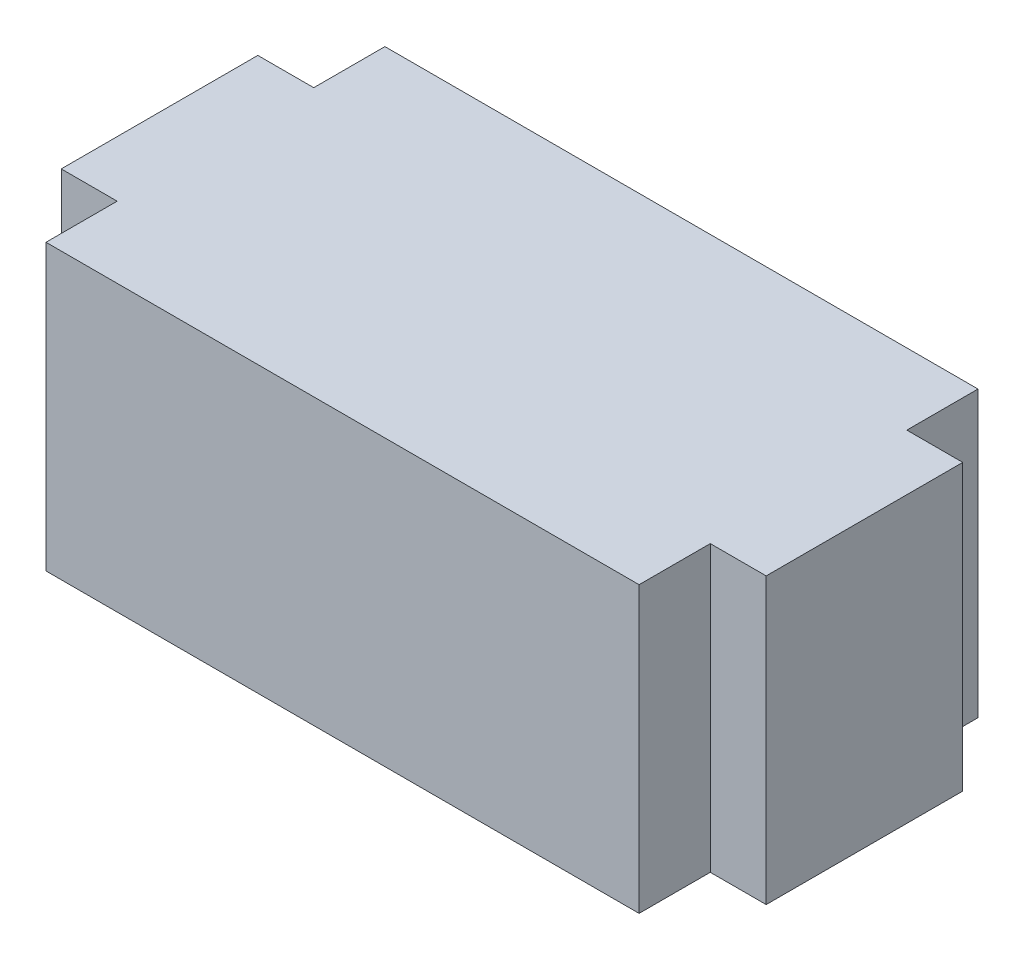
ISO-10303-21;
HEADER;
FILE_DESCRIPTION(('STEP AP214'),'2;1');
FILE_NAME('part.step','',(''),(''),'','','');
FILE_SCHEMA(('AUTOMOTIVE_DESIGN { 1 0 10303 214 1 1 1 1 }'));
ENDSEC;
DATA;
#1=APPLICATION_CONTEXT('core data for automotive mechanical design processes');
#2=APPLICATION_PROTOCOL_DEFINITION('international standard','automotive_design',2000,#1);
#3=PRODUCT_CONTEXT('',#1,'mechanical');
#4=PRODUCT('Part','Part','',(#3));
#5=PRODUCT_RELATED_PRODUCT_CATEGORY('part','',(#4));
#6=PRODUCT_DEFINITION_FORMATION('','',#4);
#7=PRODUCT_DEFINITION_CONTEXT('part definition',#1,'design');
#8=PRODUCT_DEFINITION('design','',#6,#7);
#9=PRODUCT_DEFINITION_SHAPE('','',#8);
#10=(LENGTH_UNIT() NAMED_UNIT(*) SI_UNIT(.MILLI.,.METRE.));
#11=(NAMED_UNIT(*) PLANE_ANGLE_UNIT() SI_UNIT($,.RADIAN.));
#12=(NAMED_UNIT(*) SI_UNIT($,.STERADIAN.) SOLID_ANGLE_UNIT());
#13=UNCERTAINTY_MEASURE_WITH_UNIT(LENGTH_MEASURE(1.E-05),#10,'distance_accuracy_value','');
#14=(GEOMETRIC_REPRESENTATION_CONTEXT(3) GLOBAL_UNCERTAINTY_ASSIGNED_CONTEXT((#13)) GLOBAL_UNIT_ASSIGNED_CONTEXT((#10,
#11,#12)) REPRESENTATION_CONTEXT('',''));
#15=CARTESIAN_POINT('',(0.,0.,0.));
#16=DIRECTION('',(0.,0.,1.));
#17=DIRECTION('',(1.,0.,0.));
#18=AXIS2_PLACEMENT_3D('',#15,#16,#17);
#19=CARTESIAN_POINT('',(0.,0.,2.5));
#20=DIRECTION('',(1.,0.,0.));
#21=DIRECTION('',(0.,0.,-1.));
#22=AXIS2_PLACEMENT_3D('',#19,#20,#21);
#23=PLANE('',#22);
#24=DIRECTION('',(0.,0.,-1.));
#25=VECTOR('',#24,1.);
#26=CARTESIAN_POINT('',(0.,0.,2.5));
#27=LINE('',#26,#25);
#28=CARTESIAN_POINT('',(0.,0.,1.975));
#29=VERTEX_POINT('',#28);
#30=CARTESIAN_POINT('',(0.,0.,0.525));
#31=VERTEX_POINT('',#30);
#32=EDGE_CURVE('E11',#29,#31,#27,.T.);
#33=ORIENTED_EDGE('',*,*,#32,.F.);
#34=DIRECTION('',(0.,1.,0.));
#35=VECTOR('',#34,1.);
#36=CARTESIAN_POINT('',(0.,0.,1.975));
#37=LINE('',#36,#35);
#38=CARTESIAN_POINT('',(0.,2.1,1.975));
#39=VERTEX_POINT('',#38);
#40=EDGE_CURVE('E169',#29,#39,#37,.T.);
#41=ORIENTED_EDGE('',*,*,#40,.T.);
#42=DIRECTION('',(0.,0.,-1.));
#43=VECTOR('',#42,1.);
#44=CARTESIAN_POINT('',(0.,2.1,2.5));
#45=LINE('',#44,#43);
#46=CARTESIAN_POINT('',(0.,2.1,0.525));
#47=VERTEX_POINT('',#46);
#48=EDGE_CURVE('E213',#39,#47,#45,.T.);
#49=ORIENTED_EDGE('',*,*,#48,.T.);
#50=DIRECTION('',(0.,1.,0.));
#51=VECTOR('',#50,1.);
#52=CARTESIAN_POINT('',(0.,0.,0.525));
#53=LINE('',#52,#51);
#54=EDGE_CURVE('E196',#31,#47,#53,.T.);
#55=ORIENTED_EDGE('',*,*,#54,.F.);
#56=EDGE_LOOP('',(#33,#41,#49,#55));
#57=FACE_BOUND('',#56,.T.);
#58=ADVANCED_FACE('F37',(#57),#23,.F.);
#59=CARTESIAN_POINT('',(0.,0.,2.5));
#60=DIRECTION('',(0.,1.,0.));
#61=DIRECTION('',(0.,0.,1.));
#62=AXIS2_PLACEMENT_3D('',#59,#60,#61);
#63=PLANE('',#62);
#64=DIRECTION('',(0.,0.,-1.));
#65=VECTOR('',#64,1.);
#66=CARTESIAN_POINT('',(0.4125,0.,2.5));
#67=LINE('',#66,#65);
#68=CARTESIAN_POINT('',(0.4125,0.,2.5));
#69=VERTEX_POINT('',#68);
#70=CARTESIAN_POINT('',(0.4125,0.,1.975));
#71=VERTEX_POINT('',#70);
#72=EDGE_CURVE('E59',#69,#71,#67,.T.);
#73=ORIENTED_EDGE('',*,*,#72,.T.);
#74=DIRECTION('',(-1.,0.,0.));
#75=VECTOR('',#74,1.);
#76=CARTESIAN_POINT('',(0.,0.,1.975));
#77=LINE('',#76,#75);
#78=EDGE_CURVE('E176',#71,#29,#77,.T.);
#79=ORIENTED_EDGE('',*,*,#78,.T.);
#80=ORIENTED_EDGE('',*,*,#32,.T.);
#81=DIRECTION('',(1.,0.,0.));
#82=VECTOR('',#81,1.);
#83=CARTESIAN_POINT('',(0.,0.,0.525));
#84=LINE('',#83,#82);
#85=CARTESIAN_POINT('',(0.4125,0.,0.525));
#86=VERTEX_POINT('',#85);
#87=EDGE_CURVE('E190',#31,#86,#84,.T.);
#88=ORIENTED_EDGE('',*,*,#87,.T.);
#89=DIRECTION('',(0.,0.,-1.));
#90=VECTOR('',#89,1.);
#91=CARTESIAN_POINT('',(0.4125,0.,0.));
#92=LINE('',#91,#90);
#93=CARTESIAN_POINT('',(0.4125,0.,0.));
#94=VERTEX_POINT('',#93);
#95=EDGE_CURVE('E193',#86,#94,#92,.T.);
#96=ORIENTED_EDGE('',*,*,#95,.T.);
#97=DIRECTION('',(1.,0.,0.));
#98=VECTOR('',#97,1.);
#99=CARTESIAN_POINT('',(0.,0.,0.));
#100=LINE('',#99,#98);
#101=CARTESIAN_POINT('',(4.7875,0.,0.));
#102=VERTEX_POINT('',#101);
#103=EDGE_CURVE('E149',#94,#102,#100,.T.);
#104=ORIENTED_EDGE('',*,*,#103,.T.);
#105=DIRECTION('',(0.,0.,1.));
#106=VECTOR('',#105,1.);
#107=CARTESIAN_POINT('',(4.7875,0.,0.));
#108=LINE('',#107,#106);
#109=CARTESIAN_POINT('',(4.7875,0.,0.525));
#110=VERTEX_POINT('',#109);
#111=EDGE_CURVE('E128',#102,#110,#108,.T.);
#112=ORIENTED_EDGE('',*,*,#111,.T.);
#113=DIRECTION('',(1.,0.,0.));
#114=VECTOR('',#113,1.);
#115=CARTESIAN_POINT('',(5.2,0.,0.525));
#116=LINE('',#115,#114);
#117=CARTESIAN_POINT('',(5.2,0.,0.525));
#118=VERTEX_POINT('',#117);
#119=EDGE_CURVE('E138',#110,#118,#116,.T.);
#120=ORIENTED_EDGE('',*,*,#119,.T.);
#121=DIRECTION('',(0.,0.,-1.));
#122=VECTOR('',#121,1.);
#123=CARTESIAN_POINT('',(5.2,0.,2.5));
#124=LINE('',#123,#122);
#125=CARTESIAN_POINT('',(5.2,0.,1.975));
#126=VERTEX_POINT('',#125);
#127=EDGE_CURVE('E44',#126,#118,#124,.T.);
#128=ORIENTED_EDGE('',*,*,#127,.F.);
#129=DIRECTION('',(-1.,0.,0.));
#130=VECTOR('',#129,1.);
#131=CARTESIAN_POINT('',(5.2,0.,1.975));
#132=LINE('',#131,#130);
#133=CARTESIAN_POINT('',(4.7875,0.,1.975));
#134=VERTEX_POINT('',#133);
#135=EDGE_CURVE('E159',#126,#134,#132,.T.);
#136=ORIENTED_EDGE('',*,*,#135,.T.);
#137=DIRECTION('',(0.,0.,1.));
#138=VECTOR('',#137,1.);
#139=CARTESIAN_POINT('',(4.7875,0.,2.5));
#140=LINE('',#139,#138);
#141=CARTESIAN_POINT('',(4.7875,0.,2.5));
#142=VERTEX_POINT('',#141);
#143=EDGE_CURVE('E162',#134,#142,#140,.T.);
#144=ORIENTED_EDGE('',*,*,#143,.T.);
#145=DIRECTION('',(1.,0.,0.));
#146=VECTOR('',#145,1.);
#147=CARTESIAN_POINT('',(0.,0.,2.5));
#148=LINE('',#147,#146);
#149=EDGE_CURVE('E206',#69,#142,#148,.T.);
#150=ORIENTED_EDGE('',*,*,#149,.F.);
#151=EDGE_LOOP('',(#73,#79,#80,#88,#96,#104,#112,#120,#128,#136,#144,#150));
#152=FACE_BOUND('',#151,.T.);
#153=ADVANCED_FACE('F146',(#152),#63,.F.);
#154=CARTESIAN_POINT('',(5.2,0.,2.5));
#155=DIRECTION('',(-1.,0.,0.));
#156=DIRECTION('',(0.,0.,1.));
#157=AXIS2_PLACEMENT_3D('',#154,#155,#156);
#158=PLANE('',#157);
#159=DIRECTION('',(0.,0.,-1.));
#160=VECTOR('',#159,1.);
#161=CARTESIAN_POINT('',(5.2,2.1,2.5));
#162=LINE('',#161,#160);
#163=CARTESIAN_POINT('',(5.2,2.1,1.975));
#164=VERTEX_POINT('',#163);
#165=CARTESIAN_POINT('',(5.2,2.1,0.525));
#166=VERTEX_POINT('',#165);
#167=EDGE_CURVE('E219',#164,#166,#162,.T.);
#168=ORIENTED_EDGE('',*,*,#167,.F.);
#169=DIRECTION('',(0.,1.,0.));
#170=VECTOR('',#169,1.);
#171=CARTESIAN_POINT('',(5.2,0.,1.975));
#172=LINE('',#171,#170);
#173=EDGE_CURVE('E165',#126,#164,#172,.T.);
#174=ORIENTED_EDGE('',*,*,#173,.F.);
#175=ORIENTED_EDGE('',*,*,#127,.T.);
#176=DIRECTION('',(0.,1.,0.));
#177=VECTOR('',#176,1.);
#178=CARTESIAN_POINT('',(5.2,0.,0.525));
#179=LINE('',#178,#177);
#180=EDGE_CURVE('E134',#118,#166,#179,.T.);
#181=ORIENTED_EDGE('',*,*,#180,.T.);
#182=EDGE_LOOP('',(#168,#174,#175,#181));
#183=FACE_BOUND('',#182,.T.);
#184=ADVANCED_FACE('F224',(#183),#158,.F.);
#185=CARTESIAN_POINT('',(0.,2.1,2.5));
#186=DIRECTION('',(0.,-1.,0.));
#187=DIRECTION('',(0.,0.,-1.));
#188=AXIS2_PLACEMENT_3D('',#185,#186,#187);
#189=PLANE('',#188);
#190=ORIENTED_EDGE('',*,*,#48,.F.);
#191=DIRECTION('',(-1.,0.,0.));
#192=VECTOR('',#191,1.);
#193=CARTESIAN_POINT('',(0.,2.1,1.975));
#194=LINE('',#193,#192);
#195=CARTESIAN_POINT('',(0.4125,2.1,1.975));
#196=VERTEX_POINT('',#195);
#197=EDGE_CURVE('E177',#196,#39,#194,.T.);
#198=ORIENTED_EDGE('',*,*,#197,.F.);
#199=DIRECTION('',(0.,0.,-1.));
#200=VECTOR('',#199,1.);
#201=CARTESIAN_POINT('',(0.4125,2.1,2.5));
#202=LINE('',#201,#200);
#203=CARTESIAN_POINT('',(0.4125,2.1,2.5));
#204=VERTEX_POINT('',#203);
#205=EDGE_CURVE('E181',#204,#196,#202,.T.);
#206=ORIENTED_EDGE('',*,*,#205,.F.);
#207=DIRECTION('',(-1.,0.,0.));
#208=VECTOR('',#207,1.);
#209=CARTESIAN_POINT('',(0.,2.1,2.5));
#210=LINE('',#209,#208);
#211=CARTESIAN_POINT('',(4.7875,2.1,2.5));
#212=VERTEX_POINT('',#211);
#213=EDGE_CURVE('E209',#212,#204,#210,.T.);
#214=ORIENTED_EDGE('',*,*,#213,.F.);
#215=DIRECTION('',(0.,0.,1.));
#216=VECTOR('',#215,1.);
#217=CARTESIAN_POINT('',(4.7875,2.1,2.5));
#218=LINE('',#217,#216);
#219=CARTESIAN_POINT('',(4.7875,2.1,1.975));
#220=VERTEX_POINT('',#219);
#221=EDGE_CURVE('E51',#220,#212,#218,.T.);
#222=ORIENTED_EDGE('',*,*,#221,.F.);
#223=DIRECTION('',(-1.,0.,0.));
#224=VECTOR('',#223,1.);
#225=CARTESIAN_POINT('',(5.2,2.1,1.975));
#226=LINE('',#225,#224);
#227=EDGE_CURVE('E166',#164,#220,#226,.T.);
#228=ORIENTED_EDGE('',*,*,#227,.F.);
#229=ORIENTED_EDGE('',*,*,#167,.T.);
#230=DIRECTION('',(1.,0.,0.));
#231=VECTOR('',#230,1.);
#232=CARTESIAN_POINT('',(5.2,2.1,0.525));
#233=LINE('',#232,#231);
#234=CARTESIAN_POINT('',(4.7875,2.1,0.525));
#235=VERTEX_POINT('',#234);
#236=EDGE_CURVE('E150',#235,#166,#233,.T.);
#237=ORIENTED_EDGE('',*,*,#236,.F.);
#238=DIRECTION('',(0.,0.,1.));
#239=VECTOR('',#238,1.);
#240=CARTESIAN_POINT('',(4.7875,2.1,0.));
#241=LINE('',#240,#239);
#242=CARTESIAN_POINT('',(4.7875,2.1,0.));
#243=VERTEX_POINT('',#242);
#244=EDGE_CURVE('E131',#243,#235,#241,.T.);
#245=ORIENTED_EDGE('',*,*,#244,.F.);
#246=DIRECTION('',(-1.,0.,0.));
#247=VECTOR('',#246,1.);
#248=CARTESIAN_POINT('',(0.,2.1,0.));
#249=LINE('',#248,#247);
#250=CARTESIAN_POINT('',(0.4125,2.1,0.));
#251=VERTEX_POINT('',#250);
#252=EDGE_CURVE('E210',#243,#251,#249,.T.);
#253=ORIENTED_EDGE('',*,*,#252,.T.);
#254=DIRECTION('',(0.,0.,-1.));
#255=VECTOR('',#254,1.);
#256=CARTESIAN_POINT('',(0.4125,2.1,0.));
#257=LINE('',#256,#255);
#258=CARTESIAN_POINT('',(0.4125,2.1,0.525));
#259=VERTEX_POINT('',#258);
#260=EDGE_CURVE('E194',#259,#251,#257,.T.);
#261=ORIENTED_EDGE('',*,*,#260,.F.);
#262=DIRECTION('',(1.,0.,0.));
#263=VECTOR('',#262,1.);
#264=CARTESIAN_POINT('',(0.,2.1,0.525));
#265=LINE('',#264,#263);
#266=EDGE_CURVE('E156',#47,#259,#265,.T.);
#267=ORIENTED_EDGE('',*,*,#266,.F.);
#268=EDGE_LOOP('',(#190,#198,#206,#214,#222,#228,#229,#237,#245,#253,#261,#267));
#269=FACE_BOUND('',#268,.T.);
#270=ADVANCED_FACE('F237',(#269),#189,.F.);
#271=CARTESIAN_POINT('',(0.,0.,2.5));
#272=DIRECTION('',(0.,0.,-1.));
#273=DIRECTION('',(-1.,0.,0.));
#274=AXIS2_PLACEMENT_3D('',#271,#272,#273);
#275=PLANE('',#274);
#276=ORIENTED_EDGE('',*,*,#213,.T.);
#277=DIRECTION('',(0.,1.,0.));
#278=VECTOR('',#277,1.);
#279=CARTESIAN_POINT('',(0.4125,0.,2.5));
#280=LINE('',#279,#278);
#281=EDGE_CURVE('E180',#69,#204,#280,.T.);
#282=ORIENTED_EDGE('',*,*,#281,.F.);
#283=ORIENTED_EDGE('',*,*,#149,.T.);
#284=DIRECTION('',(0.,1.,0.));
#285=VECTOR('',#284,1.);
#286=CARTESIAN_POINT('',(4.7875,0.,2.5));
#287=LINE('',#286,#285);
#288=EDGE_CURVE('E154',#142,#212,#287,.T.);
#289=ORIENTED_EDGE('',*,*,#288,.T.);
#290=EDGE_LOOP('',(#276,#282,#283,#289));
#291=FACE_BOUND('',#290,.T.);
#292=ADVANCED_FACE('F233',(#291),#275,.F.);
#293=CARTESIAN_POINT('',(0.,0.,0.));
#294=DIRECTION('',(0.,0.,-1.));
#295=DIRECTION('',(-1.,0.,0.));
#296=AXIS2_PLACEMENT_3D('',#293,#294,#295);
#297=PLANE('',#296);
#298=DIRECTION('',(0.,1.,0.));
#299=VECTOR('',#298,1.);
#300=CARTESIAN_POINT('',(4.7875,0.,0.));
#301=LINE('',#300,#299);
#302=EDGE_CURVE('E135',#102,#243,#301,.T.);
#303=ORIENTED_EDGE('',*,*,#302,.F.);
#304=ORIENTED_EDGE('',*,*,#103,.F.);
#305=DIRECTION('',(0.,1.,0.));
#306=VECTOR('',#305,1.);
#307=CARTESIAN_POINT('',(0.4125,0.,0.));
#308=LINE('',#307,#306);
#309=EDGE_CURVE('E200',#94,#251,#308,.T.);
#310=ORIENTED_EDGE('',*,*,#309,.T.);
#311=ORIENTED_EDGE('',*,*,#252,.F.);
#312=EDGE_LOOP('',(#303,#304,#310,#311));
#313=FACE_BOUND('',#312,.T.);
#314=ADVANCED_FACE('F254',(#313),#297,.T.);
#315=CARTESIAN_POINT('',(0.4125,0.,0.));
#316=DIRECTION('',(1.,0.,0.));
#317=DIRECTION('',(0.,0.,-1.));
#318=AXIS2_PLACEMENT_3D('',#315,#316,#317);
#319=PLANE('',#318);
#320=ORIENTED_EDGE('',*,*,#260,.T.);
#321=ORIENTED_EDGE('',*,*,#309,.F.);
#322=ORIENTED_EDGE('',*,*,#95,.F.);
#323=DIRECTION('',(0.,1.,0.));
#324=VECTOR('',#323,1.);
#325=CARTESIAN_POINT('',(0.4125,0.,0.525));
#326=LINE('',#325,#324);
#327=EDGE_CURVE('E203',#86,#259,#326,.T.);
#328=ORIENTED_EDGE('',*,*,#327,.T.);
#329=EDGE_LOOP('',(#320,#321,#322,#328));
#330=FACE_BOUND('',#329,.T.);
#331=ADVANCED_FACE('F251',(#330),#319,.F.);
#332=CARTESIAN_POINT('',(0.,0.,0.525));
#333=DIRECTION('',(0.,0.,1.));
#334=DIRECTION('',(1.,0.,0.));
#335=AXIS2_PLACEMENT_3D('',#332,#333,#334);
#336=PLANE('',#335);
#337=ORIENTED_EDGE('',*,*,#266,.T.);
#338=ORIENTED_EDGE('',*,*,#327,.F.);
#339=ORIENTED_EDGE('',*,*,#87,.F.);
#340=ORIENTED_EDGE('',*,*,#54,.T.);
#341=EDGE_LOOP('',(#337,#338,#339,#340));
#342=FACE_BOUND('',#341,.T.);
#343=ADVANCED_FACE('F247',(#342),#336,.F.);
#344=CARTESIAN_POINT('',(5.2,0.,0.525));
#345=DIRECTION('',(0.,0.,1.));
#346=DIRECTION('',(1.,0.,0.));
#347=AXIS2_PLACEMENT_3D('',#344,#345,#346);
#348=PLANE('',#347);
#349=ORIENTED_EDGE('',*,*,#236,.T.);
#350=ORIENTED_EDGE('',*,*,#180,.F.);
#351=ORIENTED_EDGE('',*,*,#119,.F.);
#352=DIRECTION('',(0.,1.,0.));
#353=VECTOR('',#352,1.);
#354=CARTESIAN_POINT('',(4.7875,0.,0.525));
#355=LINE('',#354,#353);
#356=EDGE_CURVE('E124',#110,#235,#355,.T.);
#357=ORIENTED_EDGE('',*,*,#356,.T.);
#358=EDGE_LOOP('',(#349,#350,#351,#357));
#359=FACE_BOUND('',#358,.T.);
#360=ADVANCED_FACE('F139',(#359),#348,.F.);
#361=CARTESIAN_POINT('',(4.7875,0.,0.));
#362=DIRECTION('',(-1.,0.,0.));
#363=DIRECTION('',(0.,0.,1.));
#364=AXIS2_PLACEMENT_3D('',#361,#362,#363);
#365=PLANE('',#364);
#366=ORIENTED_EDGE('',*,*,#244,.T.);
#367=ORIENTED_EDGE('',*,*,#356,.F.);
#368=ORIENTED_EDGE('',*,*,#111,.F.);
#369=ORIENTED_EDGE('',*,*,#302,.T.);
#370=EDGE_LOOP('',(#366,#367,#368,#369));
#371=FACE_BOUND('',#370,.T.);
#372=ADVANCED_FACE('F126',(#371),#365,.F.);
#373=CARTESIAN_POINT('',(4.7875,0.,2.5));
#374=DIRECTION('',(-1.,0.,0.));
#375=DIRECTION('',(0.,0.,1.));
#376=AXIS2_PLACEMENT_3D('',#373,#374,#375);
#377=PLANE('',#376);
#378=ORIENTED_EDGE('',*,*,#221,.T.);
#379=ORIENTED_EDGE('',*,*,#288,.F.);
#380=ORIENTED_EDGE('',*,*,#143,.F.);
#381=DIRECTION('',(0.,1.,0.));
#382=VECTOR('',#381,1.);
#383=CARTESIAN_POINT('',(4.7875,0.,1.975));
#384=LINE('',#383,#382);
#385=EDGE_CURVE('E172',#134,#220,#384,.T.);
#386=ORIENTED_EDGE('',*,*,#385,.T.);
#387=EDGE_LOOP('',(#378,#379,#380,#386));
#388=FACE_BOUND('',#387,.T.);
#389=ADVANCED_FACE('F230',(#388),#377,.F.);
#390=CARTESIAN_POINT('',(5.2,0.,1.975));
#391=DIRECTION('',(0.,0.,-1.));
#392=DIRECTION('',(-1.,0.,0.));
#393=AXIS2_PLACEMENT_3D('',#390,#391,#392);
#394=PLANE('',#393);
#395=ORIENTED_EDGE('',*,*,#227,.T.);
#396=ORIENTED_EDGE('',*,*,#385,.F.);
#397=ORIENTED_EDGE('',*,*,#135,.F.);
#398=ORIENTED_EDGE('',*,*,#173,.T.);
#399=EDGE_LOOP('',(#395,#396,#397,#398));
#400=FACE_BOUND('',#399,.T.);
#401=ADVANCED_FACE('F228',(#400),#394,.F.);
#402=CARTESIAN_POINT('',(0.,0.,1.975));
#403=DIRECTION('',(0.,0.,-1.));
#404=DIRECTION('',(-1.,0.,0.));
#405=AXIS2_PLACEMENT_3D('',#402,#403,#404);
#406=PLANE('',#405);
#407=ORIENTED_EDGE('',*,*,#197,.T.);
#408=ORIENTED_EDGE('',*,*,#40,.F.);
#409=ORIENTED_EDGE('',*,*,#78,.F.);
#410=DIRECTION('',(0.,1.,0.));
#411=VECTOR('',#410,1.);
#412=CARTESIAN_POINT('',(0.4125,0.,1.975));
#413=LINE('',#412,#411);
#414=EDGE_CURVE('E187',#71,#196,#413,.T.);
#415=ORIENTED_EDGE('',*,*,#414,.T.);
#416=EDGE_LOOP('',(#407,#408,#409,#415));
#417=FACE_BOUND('',#416,.T.);
#418=ADVANCED_FACE('F332',(#417),#406,.F.);
#419=CARTESIAN_POINT('',(0.4125,0.,2.5));
#420=DIRECTION('',(1.,0.,0.));
#421=DIRECTION('',(0.,0.,-1.));
#422=AXIS2_PLACEMENT_3D('',#419,#420,#421);
#423=PLANE('',#422);
#424=ORIENTED_EDGE('',*,*,#205,.T.);
#425=ORIENTED_EDGE('',*,*,#414,.F.);
#426=ORIENTED_EDGE('',*,*,#72,.F.);
#427=ORIENTED_EDGE('',*,*,#281,.T.);
#428=EDGE_LOOP('',(#424,#425,#426,#427));
#429=FACE_BOUND('',#428,.T.);
#430=ADVANCED_FACE('F239',(#429),#423,.F.);
#431=CLOSED_SHELL('',(#58,#153,#184,#270,#292,#314,#331,#343,#360,#372,#389,#401,#418,#430));
#432=MANIFOLD_SOLID_BREP('B2',#431);
#433=ADVANCED_BREP_SHAPE_REPRESENTATION('',(#18,#432),#14);
#434=SHAPE_DEFINITION_REPRESENTATION(#9,#433);
ENDSEC;
END-ISO-10303-21;
